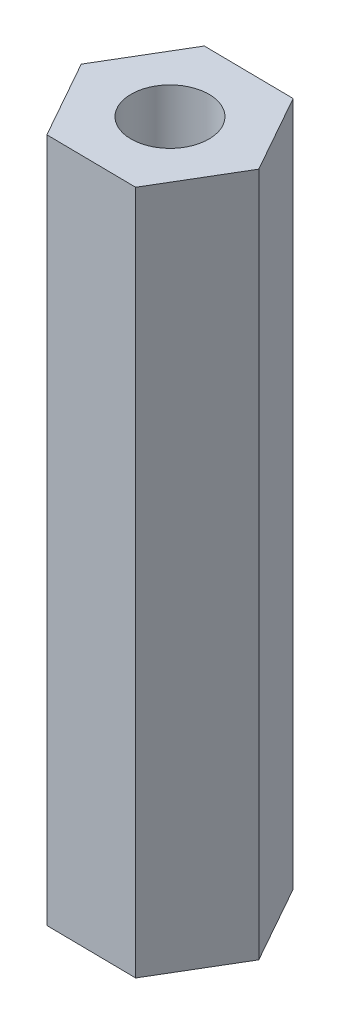
ISO-10303-21;
HEADER;
FILE_DESCRIPTION(('STEP AP214'),'2;1');
FILE_NAME('part.step','',(''),(''),'','','');
FILE_SCHEMA(('AUTOMOTIVE_DESIGN { 1 0 10303 214 1 1 1 1 }'));
ENDSEC;
DATA;
#1=APPLICATION_CONTEXT('core data for automotive mechanical design processes');
#2=APPLICATION_PROTOCOL_DEFINITION('international standard','automotive_design',2000,#1);
#3=PRODUCT_CONTEXT('',#1,'mechanical');
#4=PRODUCT('Part','Part','',(#3));
#5=PRODUCT_RELATED_PRODUCT_CATEGORY('part','',(#4));
#6=PRODUCT_DEFINITION_FORMATION('','',#4);
#7=PRODUCT_DEFINITION_CONTEXT('part definition',#1,'design');
#8=PRODUCT_DEFINITION('design','',#6,#7);
#9=PRODUCT_DEFINITION_SHAPE('','',#8);
#10=(LENGTH_UNIT() NAMED_UNIT(*) SI_UNIT(.MILLI.,.METRE.));
#11=(NAMED_UNIT(*) PLANE_ANGLE_UNIT() SI_UNIT($,.RADIAN.));
#12=(NAMED_UNIT(*) SI_UNIT($,.STERADIAN.) SOLID_ANGLE_UNIT());
#13=UNCERTAINTY_MEASURE_WITH_UNIT(LENGTH_MEASURE(1.E-05),#10,'distance_accuracy_value','');
#14=(GEOMETRIC_REPRESENTATION_CONTEXT(3) GLOBAL_UNCERTAINTY_ASSIGNED_CONTEXT((#13)) GLOBAL_UNIT_ASSIGNED_CONTEXT((#10,
#11,#12)) REPRESENTATION_CONTEXT('',''));
#15=CARTESIAN_POINT('',(0.,0.,0.));
#16=DIRECTION('',(0.,0.,1.));
#17=DIRECTION('',(1.,0.,0.));
#18=AXIS2_PLACEMENT_3D('',#15,#16,#17);
#19=CARTESIAN_POINT('',(-1.4733769045566,22.,2.48243707482235));
#20=DIRECTION('',(0.012042357348483,0.,-0.999927488185764));
#21=DIRECTION('',(-0.999927488185764,0.,-0.012042357348483));
#22=AXIS2_PLACEMENT_3D('',#19,#20,#21);
#23=PLANE('',#22);
#24=DIRECTION('',(0.999927488185764,0.,0.012042357348483));
#25=VECTOR('',#24,1.);
#26=CARTESIAN_POINT('',(-1.4733769045566,0.,2.48243707482235));
#27=LINE('',#26,#25);
#28=CARTESIAN_POINT('',(-1.4733769045566,0.,2.48243707482235));
#29=VERTEX_POINT('',#28);
#30=CARTESIAN_POINT('',(1.41316511781419,0.,2.51720036610647));
#31=VERTEX_POINT('',#30);
#32=EDGE_CURVE('E118',#29,#31,#27,.T.);
#33=ORIENTED_EDGE('',*,*,#32,.T.);
#34=DIRECTION('',(0.,-1.,0.));
#35=VECTOR('',#34,1.);
#36=CARTESIAN_POINT('',(1.41316511781419,22.,2.51720036610647));
#37=LINE('',#36,#35);
#38=CARTESIAN_POINT('',(1.41316511781419,22.,2.51720036610647));
#39=VERTEX_POINT('',#38);
#40=EDGE_CURVE('E11',#39,#31,#37,.T.);
#41=ORIENTED_EDGE('',*,*,#40,.F.);
#42=DIRECTION('',(0.999927488185764,0.,0.012042357348483));
#43=VECTOR('',#42,1.);
#44=CARTESIAN_POINT('',(-1.4733769045566,22.,2.48243707482235));
#45=LINE('',#44,#43);
#46=CARTESIAN_POINT('',(-1.4733769045566,22.,2.48243707482235));
#47=VERTEX_POINT('',#46);
#48=EDGE_CURVE('E129',#47,#39,#45,.T.);
#49=ORIENTED_EDGE('',*,*,#48,.F.);
#50=DIRECTION('',(0.,-1.,0.));
#51=VECTOR('',#50,1.);
#52=CARTESIAN_POINT('',(-1.4733769045566,22.,2.48243707482235));
#53=LINE('',#52,#51);
#54=EDGE_CURVE('E114',#47,#29,#53,.T.);
#55=ORIENTED_EDGE('',*,*,#54,.T.);
#56=EDGE_LOOP('',(#33,#41,#49,#55));
#57=FACE_BOUND('',#56,.T.);
#58=ADVANCED_FACE('F34',(#57),#23,.F.);
#59=CARTESIAN_POINT('',(1.41316511781419,22.,2.51720036610647));
#60=DIRECTION('',(-0.859941428036995,0.,-0.510392731478118));
#61=DIRECTION('',(-0.510392731478118,0.,0.859941428036995));
#62=AXIS2_PLACEMENT_3D('',#59,#60,#61);
#63=PLANE('',#62);
#64=DIRECTION('',(0.510392731478118,0.,-0.859941428036995));
#65=VECTOR('',#64,1.);
#66=CARTESIAN_POINT('',(1.41316511781419,0.,2.51720036610647));
#67=LINE('',#66,#65);
#68=CARTESIAN_POINT('',(2.88654202237079,0.,0.0347632912841201));
#69=VERTEX_POINT('',#68);
#70=EDGE_CURVE('E121',#31,#69,#67,.T.);
#71=ORIENTED_EDGE('',*,*,#70,.T.);
#72=DIRECTION('',(0.,-1.,0.));
#73=VECTOR('',#72,1.);
#74=CARTESIAN_POINT('',(2.88654202237079,22.,0.0347632912841201));
#75=LINE('',#74,#73);
#76=CARTESIAN_POINT('',(2.88654202237079,22.,0.0347632912841201));
#77=VERTEX_POINT('',#76);
#78=EDGE_CURVE('E42',#77,#69,#75,.T.);
#79=ORIENTED_EDGE('',*,*,#78,.F.);
#80=DIRECTION('',(0.510392731478118,0.,-0.859941428036995));
#81=VECTOR('',#80,1.);
#82=CARTESIAN_POINT('',(1.41316511781419,22.,2.51720036610647));
#83=LINE('',#82,#81);
#84=EDGE_CURVE('E87',#39,#77,#83,.T.);
#85=ORIENTED_EDGE('',*,*,#84,.F.);
#86=ORIENTED_EDGE('',*,*,#40,.T.);
#87=EDGE_LOOP('',(#71,#79,#85,#86));
#88=FACE_BOUND('',#87,.T.);
#89=ADVANCED_FACE('F154',(#88),#63,.F.);
#90=CARTESIAN_POINT('',(2.88654202237079,22.,0.0347632912841201));
#91=DIRECTION('',(-0.871983785385477,0.,0.489534756707646));
#92=DIRECTION('',(0.489534756707646,0.,0.871983785385477));
#93=AXIS2_PLACEMENT_3D('',#90,#91,#92);
#94=PLANE('',#93);
#95=DIRECTION('',(-0.489534756707646,0.,-0.871983785385477));
#96=VECTOR('',#95,1.);
#97=CARTESIAN_POINT('',(2.88654202237079,0.,0.0347632912841201));
#98=LINE('',#97,#96);
#99=CARTESIAN_POINT('',(1.4733769045566,0.,-2.48243707482235));
#100=VERTEX_POINT('',#99);
#101=EDGE_CURVE('E124',#69,#100,#98,.T.);
#102=ORIENTED_EDGE('',*,*,#101,.T.);
#103=DIRECTION('',(0.,-1.,0.));
#104=VECTOR('',#103,1.);
#105=CARTESIAN_POINT('',(1.4733769045566,22.,-2.48243707482235));
#106=LINE('',#105,#104);
#107=CARTESIAN_POINT('',(1.4733769045566,22.,-2.48243707482235));
#108=VERTEX_POINT('',#107);
#109=EDGE_CURVE('E109',#108,#100,#106,.T.);
#110=ORIENTED_EDGE('',*,*,#109,.F.);
#111=DIRECTION('',(-0.489534756707646,0.,-0.871983785385477));
#112=VECTOR('',#111,1.);
#113=CARTESIAN_POINT('',(2.88654202237079,22.,0.0347632912841201));
#114=LINE('',#113,#112);
#115=EDGE_CURVE('E100',#77,#108,#114,.T.);
#116=ORIENTED_EDGE('',*,*,#115,.F.);
#117=ORIENTED_EDGE('',*,*,#78,.T.);
#118=EDGE_LOOP('',(#102,#110,#116,#117));
#119=FACE_BOUND('',#118,.T.);
#120=ADVANCED_FACE('F135',(#119),#94,.F.);
#121=CARTESIAN_POINT('',(1.4733769045566,22.,-2.48243707482235));
#122=DIRECTION('',(-0.0120423573484827,0.,0.999927488185764));
#123=DIRECTION('',(0.999927488185764,0.,0.0120423573484827));
#124=AXIS2_PLACEMENT_3D('',#121,#122,#123);
#125=PLANE('',#124);
#126=DIRECTION('',(-0.999927488185764,0.,-0.0120423573484827));
#127=VECTOR('',#126,1.);
#128=CARTESIAN_POINT('',(1.4733769045566,0.,-2.48243707482235));
#129=LINE('',#128,#127);
#130=CARTESIAN_POINT('',(-1.41316511781419,0.,-2.51720036610647));
#131=VERTEX_POINT('',#130);
#132=EDGE_CURVE('E108',#100,#131,#129,.T.);
#133=ORIENTED_EDGE('',*,*,#132,.T.);
#134=DIRECTION('',(0.,-1.,0.));
#135=VECTOR('',#134,1.);
#136=CARTESIAN_POINT('',(-1.41316511781419,22.,-2.51720036610647));
#137=LINE('',#136,#135);
#138=CARTESIAN_POINT('',(-1.41316511781419,22.,-2.51720036610647));
#139=VERTEX_POINT('',#138);
#140=EDGE_CURVE('E105',#139,#131,#137,.T.);
#141=ORIENTED_EDGE('',*,*,#140,.F.);
#142=DIRECTION('',(-0.999927488185764,0.,-0.0120423573484827));
#143=VECTOR('',#142,1.);
#144=CARTESIAN_POINT('',(1.4733769045566,22.,-2.48243707482235));
#145=LINE('',#144,#143);
#146=EDGE_CURVE('E94',#108,#139,#145,.T.);
#147=ORIENTED_EDGE('',*,*,#146,.F.);
#148=ORIENTED_EDGE('',*,*,#109,.T.);
#149=EDGE_LOOP('',(#133,#141,#147,#148));
#150=FACE_BOUND('',#149,.T.);
#151=ADVANCED_FACE('F106',(#150),#125,.F.);
#152=CARTESIAN_POINT('',(-1.41316511781419,22.,-2.51720036610647));
#153=DIRECTION('',(0.859941428036995,0.,0.510392731478118));
#154=DIRECTION('',(0.510392731478118,0.,-0.859941428036995));
#155=AXIS2_PLACEMENT_3D('',#152,#153,#154);
#156=PLANE('',#155);
#157=DIRECTION('',(-0.510392731478118,0.,0.859941428036995));
#158=VECTOR('',#157,1.);
#159=CARTESIAN_POINT('',(-1.41316511781419,0.,-2.51720036610647));
#160=LINE('',#159,#158);
#161=CARTESIAN_POINT('',(-2.88654202237079,0.,-0.0347632912841212));
#162=VERTEX_POINT('',#161);
#163=EDGE_CURVE('E73',#131,#162,#160,.T.);
#164=ORIENTED_EDGE('',*,*,#163,.T.);
#165=DIRECTION('',(0.,-1.,0.));
#166=VECTOR('',#165,1.);
#167=CARTESIAN_POINT('',(-2.88654202237079,22.,-0.0347632912841212));
#168=LINE('',#167,#166);
#169=CARTESIAN_POINT('',(-2.88654202237079,22.,-0.0347632912841212));
#170=VERTEX_POINT('',#169);
#171=EDGE_CURVE('E110',#170,#162,#168,.T.);
#172=ORIENTED_EDGE('',*,*,#171,.F.);
#173=DIRECTION('',(-0.510392731478118,0.,0.859941428036995));
#174=VECTOR('',#173,1.);
#175=CARTESIAN_POINT('',(-1.41316511781419,22.,-2.51720036610647));
#176=LINE('',#175,#174);
#177=EDGE_CURVE('E98',#139,#170,#176,.T.);
#178=ORIENTED_EDGE('',*,*,#177,.F.);
#179=ORIENTED_EDGE('',*,*,#140,.T.);
#180=EDGE_LOOP('',(#164,#172,#178,#179));
#181=FACE_BOUND('',#180,.T.);
#182=ADVANCED_FACE('F112',(#181),#156,.F.);
#183=CARTESIAN_POINT('',(-2.88654202237079,22.,-0.0347632912841212));
#184=DIRECTION('',(0.871983785385477,0.,-0.489534756707645));
#185=DIRECTION('',(-0.489534756707645,0.,-0.871983785385477));
#186=AXIS2_PLACEMENT_3D('',#183,#184,#185);
#187=PLANE('',#186);
#188=DIRECTION('',(0.489534756707645,0.,0.871983785385477));
#189=VECTOR('',#188,1.);
#190=CARTESIAN_POINT('',(-2.88654202237079,0.,-0.0347632912841212));
#191=LINE('',#190,#189);
#192=EDGE_CURVE('E79',#162,#29,#191,.T.);
#193=ORIENTED_EDGE('',*,*,#192,.T.);
#194=ORIENTED_EDGE('',*,*,#54,.F.);
#195=DIRECTION('',(0.489534756707645,0.,0.871983785385477));
#196=VECTOR('',#195,1.);
#197=CARTESIAN_POINT('',(-2.88654202237079,22.,-0.0347632912841212));
#198=LINE('',#197,#196);
#199=EDGE_CURVE('E50',#170,#47,#198,.T.);
#200=ORIENTED_EDGE('',*,*,#199,.F.);
#201=ORIENTED_EDGE('',*,*,#171,.T.);
#202=EDGE_LOOP('',(#193,#194,#200,#201));
#203=FACE_BOUND('',#202,.T.);
#204=ADVANCED_FACE('F142',(#203),#187,.F.);
#205=CARTESIAN_POINT('',(0.,22.,0.));
#206=DIRECTION('',(0.,1.,0.));
#207=DIRECTION('',(0.,0.,1.));
#208=AXIS2_PLACEMENT_3D('',#205,#206,#207);
#209=PLANE('',#208);
#210=CARTESIAN_POINT('',(0.,22.,0.));
#211=DIRECTION('',(0.,1.,0.));
#212=DIRECTION('',(0.,0.,1.));
#213=AXIS2_PLACEMENT_3D('',#210,#211,#212);
#214=CIRCLE('',#213,1.25);
#215=CARTESIAN_POINT('',(0.,22.,1.25));
#216=VERTEX_POINT('',#215);
#217=EDGE_CURVE('E211',#216,#216,#214,.T.);
#218=ORIENTED_EDGE('',*,*,#217,.F.);
#219=EDGE_LOOP('',(#218));
#220=FACE_BOUND('',#219,.T.);
#221=ORIENTED_EDGE('',*,*,#48,.T.);
#222=ORIENTED_EDGE('',*,*,#84,.T.);
#223=ORIENTED_EDGE('',*,*,#115,.T.);
#224=ORIENTED_EDGE('',*,*,#146,.T.);
#225=ORIENTED_EDGE('',*,*,#177,.T.);
#226=ORIENTED_EDGE('',*,*,#199,.T.);
#227=EDGE_LOOP('',(#221,#222,#223,#224,#225,#226));
#228=FACE_BOUND('',#227,.T.);
#229=ADVANCED_FACE('F96',(#220,#228),#209,.T.);
#230=CARTESIAN_POINT('',(0.,0.,0.));
#231=DIRECTION('',(0.,1.,0.));
#232=DIRECTION('',(0.,0.,1.));
#233=AXIS2_PLACEMENT_3D('',#230,#231,#232);
#234=PLANE('',#233);
#235=CARTESIAN_POINT('',(0.,0.,0.));
#236=DIRECTION('',(0.,1.,0.));
#237=DIRECTION('',(0.,0.,1.));
#238=AXIS2_PLACEMENT_3D('',#235,#236,#237);
#239=CIRCLE('',#238,1.25);
#240=CARTESIAN_POINT('',(0.,0.,1.25));
#241=VERTEX_POINT('',#240);
#242=EDGE_CURVE('E122',#241,#241,#239,.T.);
#243=ORIENTED_EDGE('',*,*,#242,.T.);
#244=EDGE_LOOP('',(#243));
#245=FACE_BOUND('',#244,.T.);
#246=ORIENTED_EDGE('',*,*,#32,.F.);
#247=ORIENTED_EDGE('',*,*,#192,.F.);
#248=ORIENTED_EDGE('',*,*,#163,.F.);
#249=ORIENTED_EDGE('',*,*,#132,.F.);
#250=ORIENTED_EDGE('',*,*,#101,.F.);
#251=ORIENTED_EDGE('',*,*,#70,.F.);
#252=EDGE_LOOP('',(#246,#247,#248,#249,#250,#251));
#253=FACE_BOUND('',#252,.T.);
#254=ADVANCED_FACE('F138',(#245,#253),#234,.F.);
#255=CARTESIAN_POINT('',(0.,22.,0.));
#256=DIRECTION('',(0.,1.,0.));
#257=DIRECTION('',(0.,0.,1.));
#258=AXIS2_PLACEMENT_3D('',#255,#256,#257);
#259=CYLINDRICAL_SURFACE('',#258,1.25);
#260=ORIENTED_EDGE('',*,*,#242,.F.);
#261=EDGE_LOOP('',(#260));
#262=FACE_BOUND('',#261,.T.);
#263=ORIENTED_EDGE('',*,*,#217,.T.);
#264=EDGE_LOOP('',(#263));
#265=FACE_BOUND('',#264,.T.);
#266=ADVANCED_FACE('F191',(#262,#265),#259,.F.);
#267=CLOSED_SHELL('',(#58,#89,#120,#151,#182,#204,#229,#254,#266));
#268=MANIFOLD_SOLID_BREP('B2',#267);
#269=ADVANCED_BREP_SHAPE_REPRESENTATION('',(#18,#268),#14);
#270=SHAPE_DEFINITION_REPRESENTATION(#9,#269);
ENDSEC;
END-ISO-10303-21;
